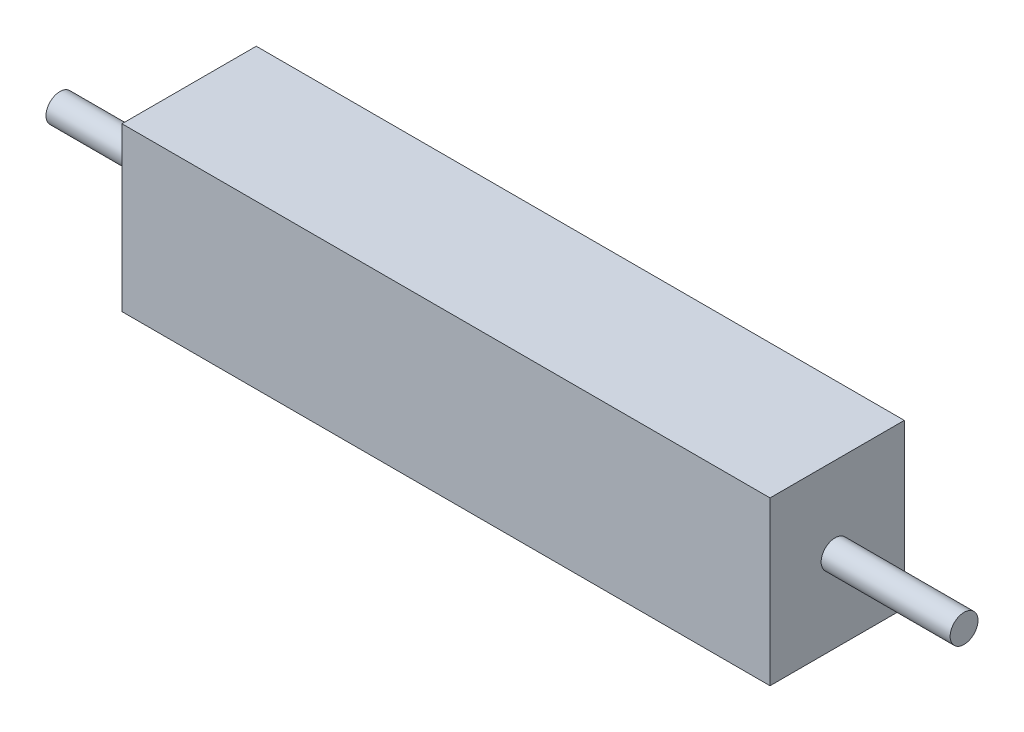
ISO-10303-21;
HEADER;
FILE_DESCRIPTION(('STEP AP214'),'2;1');
FILE_NAME('part.step','',(''),(''),'','','');
FILE_SCHEMA(('AUTOMOTIVE_DESIGN { 1 0 10303 214 1 1 1 1 }'));
ENDSEC;
DATA;
#1=APPLICATION_CONTEXT('core data for automotive mechanical design processes');
#2=APPLICATION_PROTOCOL_DEFINITION('international standard','automotive_design',2000,#1);
#3=PRODUCT_CONTEXT('',#1,'mechanical');
#4=PRODUCT('Part','Part','',(#3));
#5=PRODUCT_RELATED_PRODUCT_CATEGORY('part','',(#4));
#6=PRODUCT_DEFINITION_FORMATION('','',#4);
#7=PRODUCT_DEFINITION_CONTEXT('part definition',#1,'design');
#8=PRODUCT_DEFINITION('design','',#6,#7);
#9=PRODUCT_DEFINITION_SHAPE('','',#8);
#10=(LENGTH_UNIT() NAMED_UNIT(*) SI_UNIT(.MILLI.,.METRE.));
#11=(NAMED_UNIT(*) PLANE_ANGLE_UNIT() SI_UNIT($,.RADIAN.));
#12=(NAMED_UNIT(*) SI_UNIT($,.STERADIAN.) SOLID_ANGLE_UNIT());
#13=UNCERTAINTY_MEASURE_WITH_UNIT(LENGTH_MEASURE(1.E-05),#10,'distance_accuracy_value','');
#14=(GEOMETRIC_REPRESENTATION_CONTEXT(3) GLOBAL_UNCERTAINTY_ASSIGNED_CONTEXT((#13)) GLOBAL_UNIT_ASSIGNED_CONTEXT((#10,
#11,#12)) REPRESENTATION_CONTEXT('',''));
#15=CARTESIAN_POINT('',(0.,0.,0.));
#16=DIRECTION('',(0.,0.,1.));
#17=DIRECTION('',(1.,0.,0.));
#18=AXIS2_PLACEMENT_3D('',#15,#16,#17);
#19=CARTESIAN_POINT('',(0.,2.92,0.));
#20=DIRECTION('',(1.,0.,0.));
#21=DIRECTION('',(0.,0.,-1.));
#22=AXIS2_PLACEMENT_3D('',#19,#20,#21);
#23=PLANE('',#22);
#24=CARTESIAN_POINT('',(0.,1.41279109066872,-1.20170825722754));
#25=DIRECTION('',(1.,0.,0.));
#26=DIRECTION('',(0.,0.,-1.));
#27=AXIS2_PLACEMENT_3D('',#24,#25,#26);
#28=CIRCLE('',#27,0.25);
#29=CARTESIAN_POINT('',(0.,1.41279109066872,-1.45170825722754));
#30=VERTEX_POINT('',#29);
#31=EDGE_CURVE('E11',#30,#30,#28,.F.);
#32=ORIENTED_EDGE('',*,*,#31,.F.);
#33=EDGE_LOOP('',(#32));
#34=FACE_BOUND('',#33,.T.);
#35=DIRECTION('',(0.,0.,1.));
#36=VECTOR('',#35,1.);
#37=CARTESIAN_POINT('',(0.,0.,0.));
#38=LINE('',#37,#36);
#39=CARTESIAN_POINT('',(0.,0.,-2.41));
#40=VERTEX_POINT('',#39);
#41=CARTESIAN_POINT('',(0.,0.,0.));
#42=VERTEX_POINT('',#41);
#43=EDGE_CURVE('E100',#40,#42,#38,.T.);
#44=ORIENTED_EDGE('',*,*,#43,.T.);
#45=DIRECTION('',(0.,-1.,0.));
#46=VECTOR('',#45,1.);
#47=CARTESIAN_POINT('',(0.,2.92,0.));
#48=LINE('',#47,#46);
#49=CARTESIAN_POINT('',(0.,2.92,0.));
#50=VERTEX_POINT('',#49);
#51=EDGE_CURVE('E91',#50,#42,#48,.T.);
#52=ORIENTED_EDGE('',*,*,#51,.F.);
#53=DIRECTION('',(0.,0.,1.));
#54=VECTOR('',#53,1.);
#55=CARTESIAN_POINT('',(0.,2.92,0.));
#56=LINE('',#55,#54);
#57=CARTESIAN_POINT('',(0.,2.92,-2.41));
#58=VERTEX_POINT('',#57);
#59=EDGE_CURVE('E85',#58,#50,#56,.T.);
#60=ORIENTED_EDGE('',*,*,#59,.F.);
#61=DIRECTION('',(0.,-1.,0.));
#62=VECTOR('',#61,1.);
#63=CARTESIAN_POINT('',(0.,2.92,-2.41));
#64=LINE('',#63,#62);
#65=EDGE_CURVE('E96',#58,#40,#64,.T.);
#66=ORIENTED_EDGE('',*,*,#65,.T.);
#67=EDGE_LOOP('',(#44,#52,#60,#66));
#68=FACE_BOUND('',#67,.T.);
#69=ADVANCED_FACE('F33',(#34,#68),#23,.F.);
#70=CARTESIAN_POINT('',(0.,2.92,0.));
#71=DIRECTION('',(0.,0.,-1.));
#72=DIRECTION('',(-1.,0.,0.));
#73=AXIS2_PLACEMENT_3D('',#70,#71,#72);
#74=PLANE('',#73);
#75=DIRECTION('',(1.,0.,0.));
#76=VECTOR('',#75,1.);
#77=CARTESIAN_POINT('',(0.,0.,0.));
#78=LINE('',#77,#76);
#79=CARTESIAN_POINT('',(11.63,0.,0.));
#80=VERTEX_POINT('',#79);
#81=EDGE_CURVE('E90',#42,#80,#78,.T.);
#82=ORIENTED_EDGE('',*,*,#81,.T.);
#83=DIRECTION('',(0.,-1.,0.));
#84=VECTOR('',#83,1.);
#85=CARTESIAN_POINT('',(11.63,2.92,0.));
#86=LINE('',#85,#84);
#87=CARTESIAN_POINT('',(11.63,2.92,0.));
#88=VERTEX_POINT('',#87);
#89=EDGE_CURVE('E88',#88,#80,#86,.T.);
#90=ORIENTED_EDGE('',*,*,#89,.F.);
#91=DIRECTION('',(1.,0.,0.));
#92=VECTOR('',#91,1.);
#93=CARTESIAN_POINT('',(0.,2.92,0.));
#94=LINE('',#93,#92);
#95=EDGE_CURVE('E80',#50,#88,#94,.T.);
#96=ORIENTED_EDGE('',*,*,#95,.F.);
#97=ORIENTED_EDGE('',*,*,#51,.T.);
#98=EDGE_LOOP('',(#82,#90,#96,#97));
#99=FACE_BOUND('',#98,.T.);
#100=ADVANCED_FACE('F89',(#99),#74,.F.);
#101=CARTESIAN_POINT('',(11.63,2.92,0.));
#102=DIRECTION('',(-1.,0.,0.));
#103=DIRECTION('',(0.,0.,1.));
#104=AXIS2_PLACEMENT_3D('',#101,#102,#103);
#105=PLANE('',#104);
#106=CARTESIAN_POINT('',(11.63,1.46573323806898,-1.16715844141346));
#107=DIRECTION('',(-1.,0.,0.));
#108=DIRECTION('',(0.,0.,1.));
#109=AXIS2_PLACEMENT_3D('',#106,#107,#108);
#110=CIRCLE('',#109,0.25);
#111=CARTESIAN_POINT('',(11.63,1.46573323806898,-0.917158441413463));
#112=VERTEX_POINT('',#111);
#113=EDGE_CURVE('E41',#112,#112,#110,.F.);
#114=ORIENTED_EDGE('',*,*,#113,.F.);
#115=EDGE_LOOP('',(#114));
#116=FACE_BOUND('',#115,.T.);
#117=DIRECTION('',(0.,0.,-1.));
#118=VECTOR('',#117,1.);
#119=CARTESIAN_POINT('',(11.63,0.,0.));
#120=LINE('',#119,#118);
#121=CARTESIAN_POINT('',(11.63,0.,-2.41));
#122=VERTEX_POINT('',#121);
#123=EDGE_CURVE('E66',#80,#122,#120,.T.);
#124=ORIENTED_EDGE('',*,*,#123,.T.);
#125=DIRECTION('',(0.,-1.,0.));
#126=VECTOR('',#125,1.);
#127=CARTESIAN_POINT('',(11.63,2.92,-2.41));
#128=LINE('',#127,#126);
#129=CARTESIAN_POINT('',(11.63,2.92,-2.41));
#130=VERTEX_POINT('',#129);
#131=EDGE_CURVE('E92',#130,#122,#128,.T.);
#132=ORIENTED_EDGE('',*,*,#131,.F.);
#133=DIRECTION('',(0.,0.,-1.));
#134=VECTOR('',#133,1.);
#135=CARTESIAN_POINT('',(11.63,2.92,0.));
#136=LINE('',#135,#134);
#137=EDGE_CURVE('E83',#88,#130,#136,.T.);
#138=ORIENTED_EDGE('',*,*,#137,.F.);
#139=ORIENTED_EDGE('',*,*,#89,.T.);
#140=EDGE_LOOP('',(#124,#132,#138,#139));
#141=FACE_BOUND('',#140,.T.);
#142=ADVANCED_FACE('F94',(#116,#141),#105,.F.);
#143=CARTESIAN_POINT('',(0.,2.92,-2.41));
#144=DIRECTION('',(0.,0.,1.));
#145=DIRECTION('',(1.,0.,0.));
#146=AXIS2_PLACEMENT_3D('',#143,#144,#145);
#147=PLANE('',#146);
#148=DIRECTION('',(-1.,0.,0.));
#149=VECTOR('',#148,1.);
#150=CARTESIAN_POINT('',(0.,0.,-2.41));
#151=LINE('',#150,#149);
#152=EDGE_CURVE('E72',#122,#40,#151,.T.);
#153=ORIENTED_EDGE('',*,*,#152,.T.);
#154=ORIENTED_EDGE('',*,*,#65,.F.);
#155=DIRECTION('',(-1.,0.,0.));
#156=VECTOR('',#155,1.);
#157=CARTESIAN_POINT('',(0.,2.92,-2.41));
#158=LINE('',#157,#156);
#159=EDGE_CURVE('E49',#130,#58,#158,.T.);
#160=ORIENTED_EDGE('',*,*,#159,.F.);
#161=ORIENTED_EDGE('',*,*,#131,.T.);
#162=EDGE_LOOP('',(#153,#154,#160,#161));
#163=FACE_BOUND('',#162,.T.);
#164=ADVANCED_FACE('F115',(#163),#147,.F.);
#165=CARTESIAN_POINT('',(0.,2.92,0.));
#166=DIRECTION('',(0.,-1.,0.));
#167=DIRECTION('',(0.,0.,-1.));
#168=AXIS2_PLACEMENT_3D('',#165,#166,#167);
#169=PLANE('',#168);
#170=ORIENTED_EDGE('',*,*,#59,.T.);
#171=ORIENTED_EDGE('',*,*,#95,.T.);
#172=ORIENTED_EDGE('',*,*,#137,.T.);
#173=ORIENTED_EDGE('',*,*,#159,.T.);
#174=EDGE_LOOP('',(#170,#171,#172,#173));
#175=FACE_BOUND('',#174,.T.);
#176=ADVANCED_FACE('F81',(#175),#169,.F.);
#177=CARTESIAN_POINT('',(0.,0.,0.));
#178=DIRECTION('',(0.,-1.,0.));
#179=DIRECTION('',(0.,0.,-1.));
#180=AXIS2_PLACEMENT_3D('',#177,#178,#179);
#181=PLANE('',#180);
#182=ORIENTED_EDGE('',*,*,#43,.F.);
#183=ORIENTED_EDGE('',*,*,#152,.F.);
#184=ORIENTED_EDGE('',*,*,#123,.F.);
#185=ORIENTED_EDGE('',*,*,#81,.F.);
#186=EDGE_LOOP('',(#182,#183,#184,#185));
#187=FACE_BOUND('',#186,.T.);
#188=ADVANCED_FACE('F130',(#187),#181,.T.);
#189=CARTESIAN_POINT('',(13.945,1.46573323806898,-1.16715844141346));
#190=DIRECTION('',(-1.,0.,0.));
#191=DIRECTION('',(0.,0.,1.));
#192=AXIS2_PLACEMENT_3D('',#189,#190,#191);
#193=CYLINDRICAL_SURFACE('',#192,0.25);
#194=CARTESIAN_POINT('',(13.945,1.46573323806898,-1.16715844141346));
#195=DIRECTION('',(1.,0.,0.));
#196=DIRECTION('',(0.,0.,-1.));
#197=AXIS2_PLACEMENT_3D('',#194,#195,#196);
#198=CIRCLE('',#197,0.25);
#199=CARTESIAN_POINT('',(13.945,1.46573323806898,-1.41715844141346));
#200=VERTEX_POINT('',#199);
#201=EDGE_CURVE('E103',#200,#200,#198,.T.);
#202=ORIENTED_EDGE('',*,*,#201,.F.);
#203=EDGE_LOOP('',(#202));
#204=FACE_BOUND('',#203,.T.);
#205=ORIENTED_EDGE('',*,*,#113,.T.);
#206=EDGE_LOOP('',(#205));
#207=FACE_BOUND('',#206,.T.);
#208=ADVANCED_FACE('F112',(#204,#207),#193,.T.);
#209=CARTESIAN_POINT('',(13.945,1.46573323806898,-1.16715844141346));
#210=DIRECTION('',(1.,0.,0.));
#211=DIRECTION('',(0.,0.,-1.));
#212=AXIS2_PLACEMENT_3D('',#209,#210,#211);
#213=PLANE('',#212);
#214=ORIENTED_EDGE('',*,*,#201,.T.);
#215=EDGE_LOOP('',(#214));
#216=FACE_BOUND('',#215,.T.);
#217=ADVANCED_FACE('F137',(#216),#213,.T.);
#218=CARTESIAN_POINT('',(-2.315,1.41279109066872,-1.20170825722754));
#219=DIRECTION('',(1.,0.,0.));
#220=DIRECTION('',(0.,0.,-1.));
#221=AXIS2_PLACEMENT_3D('',#218,#219,#220);
#222=CYLINDRICAL_SURFACE('',#221,0.25);
#223=CARTESIAN_POINT('',(-2.315,1.41279109066872,-1.20170825722754));
#224=DIRECTION('',(-1.,0.,0.));
#225=DIRECTION('',(0.,0.,1.));
#226=AXIS2_PLACEMENT_3D('',#223,#224,#225);
#227=CIRCLE('',#226,0.25);
#228=CARTESIAN_POINT('',(-2.315,1.41279109066872,-0.951708257227541));
#229=VERTEX_POINT('',#228);
#230=EDGE_CURVE('E156',#229,#229,#227,.T.);
#231=ORIENTED_EDGE('',*,*,#230,.F.);
#232=EDGE_LOOP('',(#231));
#233=FACE_BOUND('',#232,.T.);
#234=ORIENTED_EDGE('',*,*,#31,.T.);
#235=EDGE_LOOP('',(#234));
#236=FACE_BOUND('',#235,.T.);
#237=ADVANCED_FACE('F144',(#233,#236),#222,.T.);
#238=CARTESIAN_POINT('',(-2.315,1.41279109066872,-1.20170825722754));
#239=DIRECTION('',(-1.,0.,0.));
#240=DIRECTION('',(0.,0.,1.));
#241=AXIS2_PLACEMENT_3D('',#238,#239,#240);
#242=PLANE('',#241);
#243=ORIENTED_EDGE('',*,*,#230,.T.);
#244=EDGE_LOOP('',(#243));
#245=FACE_BOUND('',#244,.T.);
#246=ADVANCED_FACE('F148',(#245),#242,.T.);
#247=CLOSED_SHELL('',(#69,#100,#142,#164,#176,#188,#208,#217,#237,#246));
#248=MANIFOLD_SOLID_BREP('B2',#247);
#249=ADVANCED_BREP_SHAPE_REPRESENTATION('',(#18,#248),#14);
#250=SHAPE_DEFINITION_REPRESENTATION(#9,#249);
ENDSEC;
END-ISO-10303-21;
